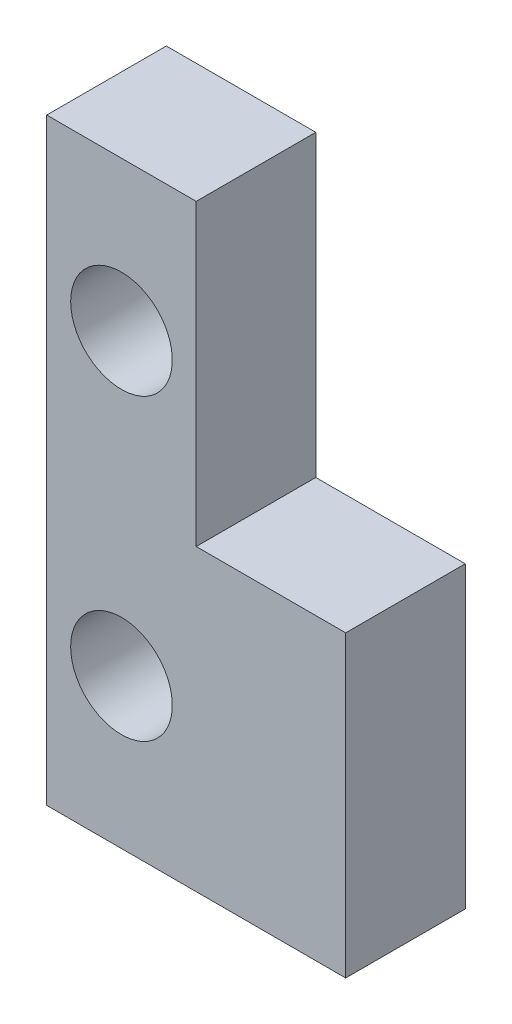
ISO-10303-21;
HEADER;
FILE_DESCRIPTION(('STEP AP214'),'2;1');
FILE_NAME('part.step','',(''),(''),'','','');
FILE_SCHEMA(('AUTOMOTIVE_DESIGN { 1 0 10303 214 1 1 1 1 }'));
ENDSEC;
DATA;
#1=APPLICATION_CONTEXT('core data for automotive mechanical design processes');
#2=APPLICATION_PROTOCOL_DEFINITION('international standard','automotive_design',2000,#1);
#3=PRODUCT_CONTEXT('',#1,'mechanical');
#4=PRODUCT('Part','Part','',(#3));
#5=PRODUCT_RELATED_PRODUCT_CATEGORY('part','',(#4));
#6=PRODUCT_DEFINITION_FORMATION('','',#4);
#7=PRODUCT_DEFINITION_CONTEXT('part definition',#1,'design');
#8=PRODUCT_DEFINITION('design','',#6,#7);
#9=PRODUCT_DEFINITION_SHAPE('','',#8);
#10=(LENGTH_UNIT() NAMED_UNIT(*) SI_UNIT(.MILLI.,.METRE.));
#11=(NAMED_UNIT(*) PLANE_ANGLE_UNIT() SI_UNIT($,.RADIAN.));
#12=(NAMED_UNIT(*) SI_UNIT($,.STERADIAN.) SOLID_ANGLE_UNIT());
#13=UNCERTAINTY_MEASURE_WITH_UNIT(LENGTH_MEASURE(1.E-05),#10,'distance_accuracy_value','');
#14=(GEOMETRIC_REPRESENTATION_CONTEXT(3) GLOBAL_UNCERTAINTY_ASSIGNED_CONTEXT((#13)) GLOBAL_UNIT_ASSIGNED_CONTEXT((#10,
#11,#12)) REPRESENTATION_CONTEXT('',''));
#15=CARTESIAN_POINT('',(0.,0.,0.));
#16=DIRECTION('',(0.,0.,1.));
#17=DIRECTION('',(1.,0.,0.));
#18=AXIS2_PLACEMENT_3D('',#15,#16,#17);
#19=CARTESIAN_POINT('',(5.,10.,4.));
#20=DIRECTION('',(-1.,0.,0.));
#21=DIRECTION('',(0.,-1.,0.));
#22=AXIS2_PLACEMENT_3D('',#19,#20,#21);
#23=PLANE('',#22);
#24=DIRECTION('',(0.,1.,0.));
#25=VECTOR('',#24,1.);
#26=CARTESIAN_POINT('',(5.,10.,0.));
#27=LINE('',#26,#25);
#28=CARTESIAN_POINT('',(5.,-10.,0.));
#29=VERTEX_POINT('',#28);
#30=CARTESIAN_POINT('',(5.,0.,0.));
#31=VERTEX_POINT('',#30);
#32=EDGE_CURVE('E106',#29,#31,#27,.T.);
#33=ORIENTED_EDGE('',*,*,#32,.T.);
#34=DIRECTION('',(0.,0.,-1.));
#35=VECTOR('',#34,1.);
#36=CARTESIAN_POINT('',(5.,0.,4.));
#37=LINE('',#36,#35);
#38=CARTESIAN_POINT('',(5.,0.,4.));
#39=VERTEX_POINT('',#38);
#40=EDGE_CURVE('E47',#39,#31,#37,.T.);
#41=ORIENTED_EDGE('',*,*,#40,.F.);
#42=DIRECTION('',(0.,1.,0.));
#43=VECTOR('',#42,1.);
#44=CARTESIAN_POINT('',(5.,10.,4.));
#45=LINE('',#44,#43);
#46=CARTESIAN_POINT('',(5.,-10.,4.));
#47=VERTEX_POINT('',#46);
#48=EDGE_CURVE('E104',#47,#39,#45,.T.);
#49=ORIENTED_EDGE('',*,*,#48,.F.);
#50=DIRECTION('',(0.,0.,-1.));
#51=VECTOR('',#50,1.);
#52=CARTESIAN_POINT('',(5.,-10.,4.));
#53=LINE('',#52,#51);
#54=EDGE_CURVE('E121',#47,#29,#53,.T.);
#55=ORIENTED_EDGE('',*,*,#54,.T.);
#56=EDGE_LOOP('',(#33,#41,#49,#55));
#57=FACE_BOUND('',#56,.T.);
#58=ADVANCED_FACE('F33',(#57),#23,.F.);
#59=CARTESIAN_POINT('',(-5.,10.,4.));
#60=DIRECTION('',(0.,-1.,0.));
#61=DIRECTION('',(0.,0.,-1.));
#62=AXIS2_PLACEMENT_3D('',#59,#60,#61);
#63=PLANE('',#62);
#64=DIRECTION('',(-1.,0.,0.));
#65=VECTOR('',#64,1.);
#66=CARTESIAN_POINT('',(-5.,10.,4.));
#67=LINE('',#66,#65);
#68=CARTESIAN_POINT('',(0.,10.,4.));
#69=VERTEX_POINT('',#68);
#70=CARTESIAN_POINT('',(-5.,10.,4.));
#71=VERTEX_POINT('',#70);
#72=EDGE_CURVE('E78',#69,#71,#67,.T.);
#73=ORIENTED_EDGE('',*,*,#72,.F.);
#74=DIRECTION('',(0.,0.,-1.));
#75=VECTOR('',#74,1.);
#76=CARTESIAN_POINT('',(0.,10.,4.));
#77=LINE('',#76,#75);
#78=CARTESIAN_POINT('',(0.,10.,0.));
#79=VERTEX_POINT('',#78);
#80=EDGE_CURVE('E140',#69,#79,#77,.T.);
#81=ORIENTED_EDGE('',*,*,#80,.T.);
#82=DIRECTION('',(-1.,0.,0.));
#83=VECTOR('',#82,1.);
#84=CARTESIAN_POINT('',(-5.,10.,0.));
#85=LINE('',#84,#83);
#86=CARTESIAN_POINT('',(-5.,10.,0.));
#87=VERTEX_POINT('',#86);
#88=EDGE_CURVE('E123',#79,#87,#85,.T.);
#89=ORIENTED_EDGE('',*,*,#88,.T.);
#90=DIRECTION('',(0.,0.,-1.));
#91=VECTOR('',#90,1.);
#92=CARTESIAN_POINT('',(-5.,10.,4.));
#93=LINE('',#92,#91);
#94=EDGE_CURVE('E11',#71,#87,#93,.T.);
#95=ORIENTED_EDGE('',*,*,#94,.F.);
#96=EDGE_LOOP('',(#73,#81,#89,#95));
#97=FACE_BOUND('',#96,.T.);
#98=ADVANCED_FACE('F172',(#97),#63,.F.);
#99=CARTESIAN_POINT('',(-5.,10.,4.));
#100=DIRECTION('',(1.,0.,0.));
#101=DIRECTION('',(0.,1.,0.));
#102=AXIS2_PLACEMENT_3D('',#99,#100,#101);
#103=PLANE('',#102);
#104=DIRECTION('',(0.,-1.,0.));
#105=VECTOR('',#104,1.);
#106=CARTESIAN_POINT('',(-5.,10.,0.));
#107=LINE('',#106,#105);
#108=CARTESIAN_POINT('',(-5.,-10.,0.));
#109=VERTEX_POINT('',#108);
#110=EDGE_CURVE('E113',#87,#109,#107,.T.);
#111=ORIENTED_EDGE('',*,*,#110,.T.);
#112=DIRECTION('',(0.,0.,-1.));
#113=VECTOR('',#112,1.);
#114=CARTESIAN_POINT('',(-5.,-10.,4.));
#115=LINE('',#114,#113);
#116=CARTESIAN_POINT('',(-5.,-10.,4.));
#117=VERTEX_POINT('',#116);
#118=EDGE_CURVE('E40',#117,#109,#115,.T.);
#119=ORIENTED_EDGE('',*,*,#118,.F.);
#120=DIRECTION('',(0.,-1.,0.));
#121=VECTOR('',#120,1.);
#122=CARTESIAN_POINT('',(-5.,10.,4.));
#123=LINE('',#122,#121);
#124=EDGE_CURVE('E111',#71,#117,#123,.T.);
#125=ORIENTED_EDGE('',*,*,#124,.F.);
#126=ORIENTED_EDGE('',*,*,#94,.T.);
#127=EDGE_LOOP('',(#111,#119,#125,#126));
#128=FACE_BOUND('',#127,.T.);
#129=ADVANCED_FACE('F176',(#128),#103,.F.);
#130=CARTESIAN_POINT('',(-5.,-10.,4.));
#131=DIRECTION('',(0.,1.,0.));
#132=DIRECTION('',(0.,0.,1.));
#133=AXIS2_PLACEMENT_3D('',#130,#131,#132);
#134=PLANE('',#133);
#135=DIRECTION('',(1.,0.,0.));
#136=VECTOR('',#135,1.);
#137=CARTESIAN_POINT('',(-5.,-10.,0.));
#138=LINE('',#137,#136);
#139=EDGE_CURVE('E73',#109,#29,#138,.T.);
#140=ORIENTED_EDGE('',*,*,#139,.T.);
#141=ORIENTED_EDGE('',*,*,#54,.F.);
#142=DIRECTION('',(1.,0.,0.));
#143=VECTOR('',#142,1.);
#144=CARTESIAN_POINT('',(-5.,-10.,4.));
#145=LINE('',#144,#143);
#146=EDGE_CURVE('E56',#117,#47,#145,.T.);
#147=ORIENTED_EDGE('',*,*,#146,.F.);
#148=ORIENTED_EDGE('',*,*,#118,.T.);
#149=EDGE_LOOP('',(#140,#141,#147,#148));
#150=FACE_BOUND('',#149,.T.);
#151=ADVANCED_FACE('F127',(#150),#134,.F.);
#152=CARTESIAN_POINT('',(0.,0.,4.));
#153=DIRECTION('',(0.,0.,1.));
#154=DIRECTION('',(1.,0.,0.));
#155=AXIS2_PLACEMENT_3D('',#152,#153,#154);
#156=PLANE('',#155);
#157=DIRECTION('',(0.,1.,0.));
#158=VECTOR('',#157,1.);
#159=CARTESIAN_POINT('',(0.,10.,4.));
#160=LINE('',#159,#158);
#161=CARTESIAN_POINT('',(0.,0.,4.));
#162=VERTEX_POINT('',#161);
#163=EDGE_CURVE('E98',#162,#69,#160,.T.);
#164=ORIENTED_EDGE('',*,*,#163,.T.);
#165=ORIENTED_EDGE('',*,*,#72,.T.);
#166=ORIENTED_EDGE('',*,*,#124,.T.);
#167=ORIENTED_EDGE('',*,*,#146,.T.);
#168=ORIENTED_EDGE('',*,*,#48,.T.);
#169=DIRECTION('',(-1.,0.,0.));
#170=VECTOR('',#169,1.);
#171=CARTESIAN_POINT('',(5.,0.,4.));
#172=LINE('',#171,#170);
#173=EDGE_CURVE('E94',#39,#162,#172,.T.);
#174=ORIENTED_EDGE('',*,*,#173,.T.);
#175=EDGE_LOOP('',(#164,#165,#166,#167,#168,#174));
#176=FACE_BOUND('',#175,.T.);
#177=CARTESIAN_POINT('',(-2.5,5.,4.));
#178=DIRECTION('',(0.,0.,-1.));
#179=DIRECTION('',(-1.,0.,0.));
#180=AXIS2_PLACEMENT_3D('',#177,#178,#179);
#181=CIRCLE('',#180,1.69999999999975);
#182=CARTESIAN_POINT('',(-4.19999999999975,5.,4.));
#183=VERTEX_POINT('',#182);
#184=EDGE_CURVE('E147',#183,#183,#181,.T.);
#185=ORIENTED_EDGE('',*,*,#184,.T.);
#186=EDGE_LOOP('',(#185));
#187=FACE_BOUND('',#186,.T.);
#188=CARTESIAN_POINT('',(-2.5,-5.,4.));
#189=DIRECTION('',(0.,0.,-1.));
#190=DIRECTION('',(-1.,0.,0.));
#191=AXIS2_PLACEMENT_3D('',#188,#189,#190);
#192=CIRCLE('',#191,1.69999999999975);
#193=CARTESIAN_POINT('',(-4.19999999999975,-5.,4.));
#194=VERTEX_POINT('',#193);
#195=EDGE_CURVE('E116',#194,#194,#192,.T.);
#196=ORIENTED_EDGE('',*,*,#195,.T.);
#197=EDGE_LOOP('',(#196));
#198=FACE_BOUND('',#197,.T.);
#199=ADVANCED_FACE('F108',(#176,#187,#198),#156,.T.);
#200=CARTESIAN_POINT('',(0.,0.,0.));
#201=DIRECTION('',(0.,0.,1.));
#202=DIRECTION('',(1.,0.,0.));
#203=AXIS2_PLACEMENT_3D('',#200,#201,#202);
#204=PLANE('',#203);
#205=CARTESIAN_POINT('',(-2.5,5.,0.));
#206=DIRECTION('',(0.,0.,-1.));
#207=DIRECTION('',(-1.,0.,0.));
#208=AXIS2_PLACEMENT_3D('',#205,#206,#207);
#209=CIRCLE('',#208,1.69999999999999);
#210=CARTESIAN_POINT('',(-4.19999999999999,5.,0.));
#211=VERTEX_POINT('',#210);
#212=EDGE_CURVE('E143',#211,#211,#209,.T.);
#213=ORIENTED_EDGE('',*,*,#212,.F.);
#214=EDGE_LOOP('',(#213));
#215=FACE_BOUND('',#214,.T.);
#216=CARTESIAN_POINT('',(-2.5,-5.,0.));
#217=DIRECTION('',(0.,0.,-1.));
#218=DIRECTION('',(-1.,0.,0.));
#219=AXIS2_PLACEMENT_3D('',#216,#217,#218);
#220=CIRCLE('',#219,1.69999999999999);
#221=CARTESIAN_POINT('',(-4.19999999999999,-5.,0.));
#222=VERTEX_POINT('',#221);
#223=EDGE_CURVE('E149',#222,#222,#220,.T.);
#224=ORIENTED_EDGE('',*,*,#223,.F.);
#225=EDGE_LOOP('',(#224));
#226=FACE_BOUND('',#225,.T.);
#227=ORIENTED_EDGE('',*,*,#88,.F.);
#228=DIRECTION('',(0.,1.,0.));
#229=VECTOR('',#228,1.);
#230=CARTESIAN_POINT('',(0.,10.,0.));
#231=LINE('',#230,#229);
#232=CARTESIAN_POINT('',(0.,0.,0.));
#233=VERTEX_POINT('',#232);
#234=EDGE_CURVE('E99',#233,#79,#231,.T.);
#235=ORIENTED_EDGE('',*,*,#234,.F.);
#236=DIRECTION('',(-1.,0.,0.));
#237=VECTOR('',#236,1.);
#238=CARTESIAN_POINT('',(5.,0.,0.));
#239=LINE('',#238,#237);
#240=EDGE_CURVE('E135',#31,#233,#239,.T.);
#241=ORIENTED_EDGE('',*,*,#240,.F.);
#242=ORIENTED_EDGE('',*,*,#32,.F.);
#243=ORIENTED_EDGE('',*,*,#139,.F.);
#244=ORIENTED_EDGE('',*,*,#110,.F.);
#245=EDGE_LOOP('',(#227,#235,#241,#242,#243,#244));
#246=FACE_BOUND('',#245,.T.);
#247=ADVANCED_FACE('F133',(#215,#226,#246),#204,.F.);
#248=CARTESIAN_POINT('',(-2.5,-5.,0.));
#249=DIRECTION('',(0.,0.,-1.));
#250=DIRECTION('',(-1.,0.,0.));
#251=AXIS2_PLACEMENT_3D('',#248,#249,#250);
#252=CYLINDRICAL_SURFACE('',#251,1.69999999999987);
#253=ORIENTED_EDGE('',*,*,#195,.F.);
#254=EDGE_LOOP('',(#253));
#255=FACE_BOUND('',#254,.T.);
#256=ORIENTED_EDGE('',*,*,#223,.T.);
#257=EDGE_LOOP('',(#256));
#258=FACE_BOUND('',#257,.T.);
#259=ADVANCED_FACE('F157',(#255,#258),#252,.F.);
#260=CARTESIAN_POINT('',(-2.5,5.,0.));
#261=DIRECTION('',(0.,0.,-1.));
#262=DIRECTION('',(-1.,0.,0.));
#263=AXIS2_PLACEMENT_3D('',#260,#261,#262);
#264=CYLINDRICAL_SURFACE('',#263,1.69999999999987);
#265=ORIENTED_EDGE('',*,*,#184,.F.);
#266=EDGE_LOOP('',(#265));
#267=FACE_BOUND('',#266,.T.);
#268=ORIENTED_EDGE('',*,*,#212,.T.);
#269=EDGE_LOOP('',(#268));
#270=FACE_BOUND('',#269,.T.);
#271=ADVANCED_FACE('F159',(#267,#270),#264,.F.);
#272=CARTESIAN_POINT('',(0.,10.,4.));
#273=DIRECTION('',(-1.,0.,0.));
#274=DIRECTION('',(0.,0.,1.));
#275=AXIS2_PLACEMENT_3D('',#272,#273,#274);
#276=PLANE('',#275);
#277=ORIENTED_EDGE('',*,*,#234,.T.);
#278=ORIENTED_EDGE('',*,*,#80,.F.);
#279=ORIENTED_EDGE('',*,*,#163,.F.);
#280=DIRECTION('',(0.,0.,-1.));
#281=VECTOR('',#280,1.);
#282=CARTESIAN_POINT('',(0.,0.,4.));
#283=LINE('',#282,#281);
#284=EDGE_CURVE('E96',#162,#233,#283,.T.);
#285=ORIENTED_EDGE('',*,*,#284,.T.);
#286=EDGE_LOOP('',(#277,#278,#279,#285));
#287=FACE_BOUND('',#286,.T.);
#288=ADVANCED_FACE('F165',(#287),#276,.F.);
#289=CARTESIAN_POINT('',(5.,0.,4.));
#290=DIRECTION('',(0.,-1.,0.));
#291=DIRECTION('',(0.,0.,-1.));
#292=AXIS2_PLACEMENT_3D('',#289,#290,#291);
#293=PLANE('',#292);
#294=ORIENTED_EDGE('',*,*,#240,.T.);
#295=ORIENTED_EDGE('',*,*,#284,.F.);
#296=ORIENTED_EDGE('',*,*,#173,.F.);
#297=ORIENTED_EDGE('',*,*,#40,.T.);
#298=EDGE_LOOP('',(#294,#295,#296,#297));
#299=FACE_BOUND('',#298,.T.);
#300=ADVANCED_FACE('F95',(#299),#293,.F.);
#301=CLOSED_SHELL('',(#58,#98,#129,#151,#199,#247,#259,#271,#288,#300));
#302=MANIFOLD_SOLID_BREP('B2',#301);
#303=ADVANCED_BREP_SHAPE_REPRESENTATION('',(#18,#302),#14);
#304=SHAPE_DEFINITION_REPRESENTATION(#9,#303);
ENDSEC;
END-ISO-10303-21;
